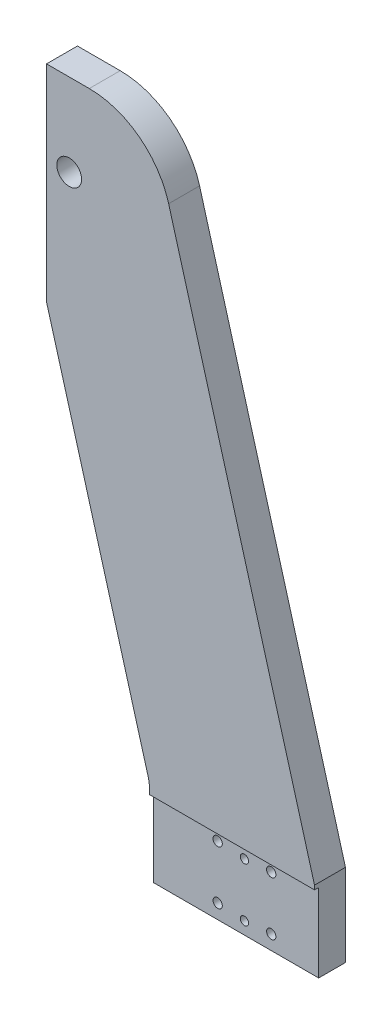
ISO-10303-21;
HEADER;
FILE_DESCRIPTION(('STEP AP214'),'2;1');
FILE_NAME('part.step','',(''),(''),'','','');
FILE_SCHEMA(('AUTOMOTIVE_DESIGN { 1 0 10303 214 1 1 1 1 }'));
ENDSEC;
DATA;
#1=APPLICATION_CONTEXT('core data for automotive mechanical design processes');
#2=APPLICATION_PROTOCOL_DEFINITION('international standard','automotive_design',2000,#1);
#3=PRODUCT_CONTEXT('',#1,'mechanical');
#4=PRODUCT('Part','Part','',(#3));
#5=PRODUCT_RELATED_PRODUCT_CATEGORY('part','',(#4));
#6=PRODUCT_DEFINITION_FORMATION('','',#4);
#7=PRODUCT_DEFINITION_CONTEXT('part definition',#1,'design');
#8=PRODUCT_DEFINITION('design','',#6,#7);
#9=PRODUCT_DEFINITION_SHAPE('','',#8);
#10=(LENGTH_UNIT() NAMED_UNIT(*) SI_UNIT(.MILLI.,.METRE.));
#11=(NAMED_UNIT(*) PLANE_ANGLE_UNIT() SI_UNIT($,.RADIAN.));
#12=(NAMED_UNIT(*) SI_UNIT($,.STERADIAN.) SOLID_ANGLE_UNIT());
#13=UNCERTAINTY_MEASURE_WITH_UNIT(LENGTH_MEASURE(1.E-05),#10,'distance_accuracy_value','');
#14=(GEOMETRIC_REPRESENTATION_CONTEXT(3) GLOBAL_UNCERTAINTY_ASSIGNED_CONTEXT((#13)) GLOBAL_UNIT_ASSIGNED_CONTEXT((#10,
#11,#12)) REPRESENTATION_CONTEXT('',''));
#15=CARTESIAN_POINT('',(0.,0.,0.));
#16=DIRECTION('',(0.,0.,1.));
#17=DIRECTION('',(1.,0.,0.));
#18=AXIS2_PLACEMENT_3D('',#15,#16,#17);
#19=CARTESIAN_POINT('',(-29.268839302064,280.,15.));
#20=DIRECTION('',(0.,0.,-1.));
#21=DIRECTION('',(-1.,0.,0.));
#22=AXIS2_PLACEMENT_3D('',#19,#20,#21);
#23=CYLINDRICAL_SURFACE('',#22,40.);
#24=CARTESIAN_POINT('',(-29.268839302064,280.,0.));
#25=DIRECTION('',(0.,0.,1.));
#26=DIRECTION('',(1.,0.,0.));
#27=AXIS2_PLACEMENT_3D('',#24,#25,#26);
#28=CIRCLE('',#27,40.);
#29=CARTESIAN_POINT('',(9.22850948471156,290.86066924224,0.));
#30=VERTEX_POINT('',#29);
#31=CARTESIAN_POINT('',(-29.268839302064,320.,0.));
#32=VERTEX_POINT('',#31);
#33=EDGE_CURVE('E155',#30,#32,#28,.T.);
#34=ORIENTED_EDGE('',*,*,#33,.T.);
#35=DIRECTION('',(0.,0.,-1.));
#36=VECTOR('',#35,1.);
#37=CARTESIAN_POINT('',(-29.268839302064,320.,15.));
#38=LINE('',#37,#36);
#39=CARTESIAN_POINT('',(-29.268839302064,320.,15.));
#40=VERTEX_POINT('',#39);
#41=EDGE_CURVE('E11',#40,#32,#38,.T.);
#42=ORIENTED_EDGE('',*,*,#41,.F.);
#43=CARTESIAN_POINT('',(-29.268839302064,280.,15.));
#44=DIRECTION('',(0.,0.,1.));
#45=DIRECTION('',(1.,0.,0.));
#46=AXIS2_PLACEMENT_3D('',#43,#44,#45);
#47=CIRCLE('',#46,40.);
#48=CARTESIAN_POINT('',(9.22850948471156,290.86066924224,15.));
#49=VERTEX_POINT('',#48);
#50=EDGE_CURVE('E174',#49,#40,#47,.T.);
#51=ORIENTED_EDGE('',*,*,#50,.F.);
#52=DIRECTION('',(0.,0.,-1.));
#53=VECTOR('',#52,1.);
#54=CARTESIAN_POINT('',(9.22850948471156,290.86066924224,15.));
#55=LINE('',#54,#53);
#56=EDGE_CURVE('E154',#49,#30,#55,.T.);
#57=ORIENTED_EDGE('',*,*,#56,.T.);
#58=EDGE_LOOP('',(#34,#42,#51,#57));
#59=FACE_BOUND('',#58,.T.);
#60=ADVANCED_FACE('F37',(#59),#23,.T.);
#61=CARTESIAN_POINT('',(-50.,320.,15.));
#62=DIRECTION('',(0.,-1.,0.));
#63=DIRECTION('',(1.,0.,0.));
#64=AXIS2_PLACEMENT_3D('',#61,#62,#63);
#65=PLANE('',#64);
#66=DIRECTION('',(-1.,0.,0.));
#67=VECTOR('',#66,1.);
#68=CARTESIAN_POINT('',(-50.,320.,0.));
#69=LINE('',#68,#67);
#70=CARTESIAN_POINT('',(-50.,320.,0.));
#71=VERTEX_POINT('',#70);
#72=EDGE_CURVE('E158',#32,#71,#69,.T.);
#73=ORIENTED_EDGE('',*,*,#72,.T.);
#74=DIRECTION('',(0.,0.,-1.));
#75=VECTOR('',#74,1.);
#76=CARTESIAN_POINT('',(-50.,320.,15.));
#77=LINE('',#76,#75);
#78=CARTESIAN_POINT('',(-50.,320.,15.));
#79=VERTEX_POINT('',#78);
#80=EDGE_CURVE('E45',#79,#71,#77,.T.);
#81=ORIENTED_EDGE('',*,*,#80,.F.);
#82=DIRECTION('',(-1.,0.,0.));
#83=VECTOR('',#82,1.);
#84=CARTESIAN_POINT('',(-50.,320.,15.));
#85=LINE('',#84,#83);
#86=EDGE_CURVE('E106',#40,#79,#85,.T.);
#87=ORIENTED_EDGE('',*,*,#86,.F.);
#88=ORIENTED_EDGE('',*,*,#41,.T.);
#89=EDGE_LOOP('',(#73,#81,#87,#88));
#90=FACE_BOUND('',#89,.T.);
#91=ADVANCED_FACE('F387',(#90),#65,.F.);
#92=CARTESIAN_POINT('',(-50.,320.,15.));
#93=DIRECTION('',(1.,0.,0.));
#94=DIRECTION('',(0.,1.,0.));
#95=AXIS2_PLACEMENT_3D('',#92,#93,#94);
#96=PLANE('',#95);
#97=CARTESIAN_POINT('',(-50.,312.,6.));
#98=DIRECTION('',(-1.,0.,0.));
#99=DIRECTION('',(0.,0.,1.));
#100=AXIS2_PLACEMENT_3D('',#97,#98,#99);
#101=CIRCLE('',#100,1.64999999999998);
#102=CARTESIAN_POINT('',(-50.,312.,7.64999999999999));
#103=VERTEX_POINT('',#102);
#104=EDGE_CURVE('E190',#103,#103,#101,.T.);
#105=ORIENTED_EDGE('',*,*,#104,.F.);
#106=EDGE_LOOP('',(#105));
#107=FACE_BOUND('',#106,.T.);
#108=CARTESIAN_POINT('',(-50.,248.,6.));
#109=DIRECTION('',(-1.,0.,0.));
#110=DIRECTION('',(0.,0.,1.));
#111=AXIS2_PLACEMENT_3D('',#108,#109,#110);
#112=CIRCLE('',#111,1.64999999999998);
#113=CARTESIAN_POINT('',(-50.,248.,7.64999999999999));
#114=VERTEX_POINT('',#113);
#115=EDGE_CURVE('E253',#114,#114,#112,.T.);
#116=ORIENTED_EDGE('',*,*,#115,.F.);
#117=EDGE_LOOP('',(#116));
#118=FACE_BOUND('',#117,.T.);
#119=CARTESIAN_POINT('',(-50.,291.,6.));
#120=DIRECTION('',(-1.,0.,0.));
#121=DIRECTION('',(0.,0.,1.));
#122=AXIS2_PLACEMENT_3D('',#119,#120,#121);
#123=CIRCLE('',#122,1.64999999999998);
#124=CARTESIAN_POINT('',(-50.,291.,7.64999999999999));
#125=VERTEX_POINT('',#124);
#126=EDGE_CURVE('E259',#125,#125,#123,.T.);
#127=ORIENTED_EDGE('',*,*,#126,.F.);
#128=EDGE_LOOP('',(#127));
#129=FACE_BOUND('',#128,.T.);
#130=CARTESIAN_POINT('',(-50.,269.,6.));
#131=DIRECTION('',(-1.,0.,0.));
#132=DIRECTION('',(0.,0.,1.));
#133=AXIS2_PLACEMENT_3D('',#130,#131,#132);
#134=CIRCLE('',#133,1.64999999999998);
#135=CARTESIAN_POINT('',(-50.,269.,7.64999999999999));
#136=VERTEX_POINT('',#135);
#137=EDGE_CURVE('E265',#136,#136,#134,.T.);
#138=ORIENTED_EDGE('',*,*,#137,.F.);
#139=EDGE_LOOP('',(#138));
#140=FACE_BOUND('',#139,.T.);
#141=CARTESIAN_POINT('',(-50.,304.,6.));
#142=DIRECTION('',(-1.,0.,0.));
#143=DIRECTION('',(0.,0.,1.));
#144=AXIS2_PLACEMENT_3D('',#141,#142,#143);
#145=CIRCLE('',#144,2.);
#146=CARTESIAN_POINT('',(-50.,304.,8.));
#147=VERTEX_POINT('',#146);
#148=EDGE_CURVE('E271',#147,#147,#145,.T.);
#149=ORIENTED_EDGE('',*,*,#148,.F.);
#150=EDGE_LOOP('',(#149));
#151=FACE_BOUND('',#150,.T.);
#152=CARTESIAN_POINT('',(-50.,256.,6.));
#153=DIRECTION('',(-1.,0.,0.));
#154=DIRECTION('',(0.,0.,1.));
#155=AXIS2_PLACEMENT_3D('',#152,#153,#154);
#156=CIRCLE('',#155,2.);
#157=CARTESIAN_POINT('',(-50.,256.,8.));
#158=VERTEX_POINT('',#157);
#159=EDGE_CURVE('E277',#158,#158,#156,.T.);
#160=ORIENTED_EDGE('',*,*,#159,.F.);
#161=EDGE_LOOP('',(#160));
#162=FACE_BOUND('',#161,.T.);
#163=DIRECTION('',(0.,-1.,0.));
#164=VECTOR('',#163,1.);
#165=CARTESIAN_POINT('',(-50.,320.,0.));
#166=LINE('',#165,#164);
#167=CARTESIAN_POINT('',(-50.,220.,0.));
#168=VERTEX_POINT('',#167);
#169=EDGE_CURVE('E161',#71,#168,#166,.T.);
#170=ORIENTED_EDGE('',*,*,#169,.T.);
#171=DIRECTION('',(0.,0.,-1.));
#172=VECTOR('',#171,1.);
#173=CARTESIAN_POINT('',(-50.,220.,15.));
#174=LINE('',#173,#172);
#175=CARTESIAN_POINT('',(-50.,220.,15.));
#176=VERTEX_POINT('',#175);
#177=EDGE_CURVE('E182',#176,#168,#174,.T.);
#178=ORIENTED_EDGE('',*,*,#177,.F.);
#179=DIRECTION('',(0.,-1.,0.));
#180=VECTOR('',#179,1.);
#181=CARTESIAN_POINT('',(-50.,320.,15.));
#182=LINE('',#181,#180);
#183=EDGE_CURVE('E318',#79,#176,#182,.T.);
#184=ORIENTED_EDGE('',*,*,#183,.F.);
#185=ORIENTED_EDGE('',*,*,#80,.T.);
#186=EDGE_LOOP('',(#170,#178,#184,#185));
#187=FACE_BOUND('',#186,.T.);
#188=ADVANCED_FACE('F322',(#107,#118,#129,#140,#151,#162,#187),#96,.F.);
#189=CARTESIAN_POINT('',(-50.,220.,15.));
#190=DIRECTION('',(0.96243371966939,0.27151673105601,0.));
#191=DIRECTION('',(-0.27151673105601,0.96243371966939,0.));
#192=AXIS2_PLACEMENT_3D('',#189,#190,#191);
#193=PLANE('',#192);
#194=DIRECTION('',(0.27151673105601,-0.96243371966939,0.));
#195=VECTOR('',#194,1.);
#196=CARTESIAN_POINT('',(-50.,220.,0.));
#197=LINE('',#196,#195);
#198=CARTESIAN_POINT('',(-0.751325606612161,45.4303346211202,0.));
#199=VERTEX_POINT('',#198);
#200=EDGE_CURVE('E163',#168,#199,#197,.T.);
#201=ORIENTED_EDGE('',*,*,#200,.T.);
#202=DIRECTION('',(0.,0.,-1.));
#203=VECTOR('',#202,1.);
#204=CARTESIAN_POINT('',(-0.751325606612161,45.4303346211202,15.));
#205=LINE('',#204,#203);
#206=CARTESIAN_POINT('',(-0.751325606612161,45.4303346211202,15.));
#207=VERTEX_POINT('',#206);
#208=EDGE_CURVE('E140',#207,#199,#205,.T.);
#209=ORIENTED_EDGE('',*,*,#208,.F.);
#210=DIRECTION('',(0.27151673105601,-0.96243371966939,0.));
#211=VECTOR('',#210,1.);
#212=CARTESIAN_POINT('',(-50.,220.,15.));
#213=LINE('',#212,#211);
#214=EDGE_CURVE('E127',#176,#207,#213,.T.);
#215=ORIENTED_EDGE('',*,*,#214,.F.);
#216=ORIENTED_EDGE('',*,*,#177,.T.);
#217=EDGE_LOOP('',(#201,#209,#215,#216));
#218=FACE_BOUND('',#217,.T.);
#219=ADVANCED_FACE('F326',(#218),#193,.F.);
#220=CARTESIAN_POINT('',(-20.,40.,15.));
#221=DIRECTION('',(0.,0.,-1.));
#222=DIRECTION('',(-1.,0.,0.));
#223=AXIS2_PLACEMENT_3D('',#220,#221,#222);
#224=CYLINDRICAL_SURFACE('',#223,20.);
#225=CARTESIAN_POINT('',(-20.,40.,0.));
#226=DIRECTION('',(0.,0.,-1.));
#227=DIRECTION('',(-1.,0.,0.));
#228=AXIS2_PLACEMENT_3D('',#225,#226,#227);
#229=CIRCLE('',#228,20.);
#230=CARTESIAN_POINT('',(0.,40.,0.));
#231=VERTEX_POINT('',#230);
#232=EDGE_CURVE('E136',#199,#231,#229,.T.);
#233=ORIENTED_EDGE('',*,*,#232,.T.);
#234=DIRECTION('',(0.,0.,-1.));
#235=VECTOR('',#234,1.);
#236=CARTESIAN_POINT('',(0.,40.,15.));
#237=LINE('',#236,#235);
#238=CARTESIAN_POINT('',(0.,40.,15.));
#239=VERTEX_POINT('',#238);
#240=EDGE_CURVE('E133',#239,#231,#237,.T.);
#241=ORIENTED_EDGE('',*,*,#240,.F.);
#242=CARTESIAN_POINT('',(-20.,40.,15.));
#243=DIRECTION('',(0.,0.,-1.));
#244=DIRECTION('',(-1.,0.,0.));
#245=AXIS2_PLACEMENT_3D('',#242,#243,#244);
#246=CIRCLE('',#245,20.);
#247=EDGE_CURVE('E119',#207,#239,#246,.T.);
#248=ORIENTED_EDGE('',*,*,#247,.F.);
#249=ORIENTED_EDGE('',*,*,#208,.T.);
#250=EDGE_LOOP('',(#233,#241,#248,#249));
#251=FACE_BOUND('',#250,.T.);
#252=ADVANCED_FACE('F134',(#251),#224,.F.);
#253=CARTESIAN_POINT('',(0.,40.,15.));
#254=DIRECTION('',(1.,0.,0.));
#255=DIRECTION('',(0.,1.,0.));
#256=AXIS2_PLACEMENT_3D('',#253,#254,#255);
#257=PLANE('',#256);
#258=DIRECTION('',(0.,-1.,0.));
#259=VECTOR('',#258,1.);
#260=CARTESIAN_POINT('',(0.,0.,13.));
#261=LINE('',#260,#259);
#262=CARTESIAN_POINT('',(0.,38.,13.));
#263=VERTEX_POINT('',#262);
#264=CARTESIAN_POINT('',(0.,0.,13.));
#265=VERTEX_POINT('',#264);
#266=EDGE_CURVE('E284',#263,#265,#261,.T.);
#267=ORIENTED_EDGE('',*,*,#266,.F.);
#268=DIRECTION('',(0.,0.,1.));
#269=VECTOR('',#268,1.);
#270=CARTESIAN_POINT('',(0.,38.,13.));
#271=LINE('',#270,#269);
#272=CARTESIAN_POINT('',(0.,38.,15.));
#273=VERTEX_POINT('',#272);
#274=EDGE_CURVE('E147',#263,#273,#271,.T.);
#275=ORIENTED_EDGE('',*,*,#274,.T.);
#276=DIRECTION('',(0.,-1.,0.));
#277=VECTOR('',#276,1.);
#278=CARTESIAN_POINT('',(0.,40.,15.));
#279=LINE('',#278,#277);
#280=EDGE_CURVE('E125',#239,#273,#279,.T.);
#281=ORIENTED_EDGE('',*,*,#280,.F.);
#282=ORIENTED_EDGE('',*,*,#240,.T.);
#283=DIRECTION('',(0.,-1.,0.));
#284=VECTOR('',#283,1.);
#285=CARTESIAN_POINT('',(0.,40.,0.));
#286=LINE('',#285,#284);
#287=CARTESIAN_POINT('',(0.,0.,0.));
#288=VERTEX_POINT('',#287);
#289=EDGE_CURVE('E166',#231,#288,#286,.T.);
#290=ORIENTED_EDGE('',*,*,#289,.T.);
#291=DIRECTION('',(0.,0.,-1.));
#292=VECTOR('',#291,1.);
#293=CARTESIAN_POINT('',(0.,0.,15.));
#294=LINE('',#293,#292);
#295=EDGE_CURVE('E141',#265,#288,#294,.T.);
#296=ORIENTED_EDGE('',*,*,#295,.F.);
#297=EDGE_LOOP('',(#267,#275,#281,#282,#290,#296));
#298=FACE_BOUND('',#297,.T.);
#299=ADVANCED_FACE('F145',(#298),#257,.F.);
#300=CARTESIAN_POINT('',(0.,0.,15.));
#301=DIRECTION('',(0.,1.,0.));
#302=DIRECTION('',(0.,0.,1.));
#303=AXIS2_PLACEMENT_3D('',#300,#301,#302);
#304=PLANE('',#303);
#305=DIRECTION('',(0.,0.,-1.));
#306=VECTOR('',#305,1.);
#307=CARTESIAN_POINT('',(80.,0.,15.));
#308=LINE('',#307,#306);
#309=CARTESIAN_POINT('',(80.,0.,13.));
#310=VERTEX_POINT('',#309);
#311=CARTESIAN_POINT('',(80.,0.,0.));
#312=VERTEX_POINT('',#311);
#313=EDGE_CURVE('E178',#310,#312,#308,.T.);
#314=ORIENTED_EDGE('',*,*,#313,.F.);
#315=DIRECTION('',(1.,0.,0.));
#316=VECTOR('',#315,1.);
#317=CARTESIAN_POINT('',(0.,0.,13.));
#318=LINE('',#317,#316);
#319=EDGE_CURVE('E287',#265,#310,#318,.T.);
#320=ORIENTED_EDGE('',*,*,#319,.F.);
#321=ORIENTED_EDGE('',*,*,#295,.T.);
#322=DIRECTION('',(1.,0.,0.));
#323=VECTOR('',#322,1.);
#324=CARTESIAN_POINT('',(0.,0.,0.));
#325=LINE('',#324,#323);
#326=EDGE_CURVE('E168',#288,#312,#325,.T.);
#327=ORIENTED_EDGE('',*,*,#326,.T.);
#328=EDGE_LOOP('',(#314,#320,#321,#327));
#329=FACE_BOUND('',#328,.T.);
#330=ADVANCED_FACE('F340',(#329),#304,.F.);
#331=CARTESIAN_POINT('',(80.,0.,15.));
#332=DIRECTION('',(-1.,0.,0.));
#333=DIRECTION('',(0.,-1.,0.));
#334=AXIS2_PLACEMENT_3D('',#331,#332,#333);
#335=PLANE('',#334);
#336=DIRECTION('',(0.,1.,0.));
#337=VECTOR('',#336,1.);
#338=CARTESIAN_POINT('',(80.,0.,15.));
#339=LINE('',#338,#337);
#340=CARTESIAN_POINT('',(80.,38.,15.));
#341=VERTEX_POINT('',#340);
#342=CARTESIAN_POINT('',(80.,40.,15.));
#343=VERTEX_POINT('',#342);
#344=EDGE_CURVE('E148',#341,#343,#339,.T.);
#345=ORIENTED_EDGE('',*,*,#344,.F.);
#346=DIRECTION('',(0.,0.,1.));
#347=VECTOR('',#346,1.);
#348=CARTESIAN_POINT('',(80.,38.,13.));
#349=LINE('',#348,#347);
#350=CARTESIAN_POINT('',(80.,38.,13.));
#351=VERTEX_POINT('',#350);
#352=EDGE_CURVE('E53',#351,#341,#349,.T.);
#353=ORIENTED_EDGE('',*,*,#352,.F.);
#354=DIRECTION('',(0.,1.,0.));
#355=VECTOR('',#354,1.);
#356=CARTESIAN_POINT('',(80.,0.,13.));
#357=LINE('',#356,#355);
#358=EDGE_CURVE('E290',#310,#351,#357,.T.);
#359=ORIENTED_EDGE('',*,*,#358,.F.);
#360=ORIENTED_EDGE('',*,*,#313,.T.);
#361=DIRECTION('',(0.,1.,0.));
#362=VECTOR('',#361,1.);
#363=CARTESIAN_POINT('',(80.,0.,0.));
#364=LINE('',#363,#362);
#365=CARTESIAN_POINT('',(80.,40.,0.));
#366=VERTEX_POINT('',#365);
#367=EDGE_CURVE('E171',#312,#366,#364,.T.);
#368=ORIENTED_EDGE('',*,*,#367,.T.);
#369=DIRECTION('',(0.,0.,-1.));
#370=VECTOR('',#369,1.);
#371=CARTESIAN_POINT('',(80.,40.,15.));
#372=LINE('',#371,#370);
#373=EDGE_CURVE('E176',#343,#366,#372,.T.);
#374=ORIENTED_EDGE('',*,*,#373,.F.);
#375=EDGE_LOOP('',(#345,#353,#359,#360,#368,#374));
#376=FACE_BOUND('',#375,.T.);
#377=ADVANCED_FACE('F348',(#376),#335,.F.);
#378=CARTESIAN_POINT('',(9.22850948471156,290.86066924224,15.));
#379=DIRECTION('',(-0.96243371966939,-0.27151673105601,0.));
#380=DIRECTION('',(0.27151673105601,-0.96243371966939,0.));
#381=AXIS2_PLACEMENT_3D('',#378,#379,#380);
#382=PLANE('',#381);
#383=DIRECTION('',(-0.27151673105601,0.96243371966939,0.));
#384=VECTOR('',#383,1.);
#385=CARTESIAN_POINT('',(9.22850948471156,290.86066924224,0.));
#386=LINE('',#385,#384);
#387=EDGE_CURVE('E98',#366,#30,#386,.T.);
#388=ORIENTED_EDGE('',*,*,#387,.T.);
#389=ORIENTED_EDGE('',*,*,#56,.F.);
#390=DIRECTION('',(-0.27151673105601,0.96243371966939,0.));
#391=VECTOR('',#390,1.);
#392=CARTESIAN_POINT('',(9.22850948471156,290.86066924224,15.));
#393=LINE('',#392,#391);
#394=EDGE_CURVE('E62',#343,#49,#393,.T.);
#395=ORIENTED_EDGE('',*,*,#394,.F.);
#396=ORIENTED_EDGE('',*,*,#373,.T.);
#397=EDGE_LOOP('',(#388,#389,#395,#396));
#398=FACE_BOUND('',#397,.T.);
#399=ADVANCED_FACE('F394',(#398),#382,.F.);
#400=CARTESIAN_POINT('',(-29.268839302064,280.,15.));
#401=DIRECTION('',(0.,0.,1.));
#402=DIRECTION('',(1.,0.,0.));
#403=AXIS2_PLACEMENT_3D('',#400,#401,#402);
#404=PLANE('',#403);
#405=DIRECTION('',(-1.,0.,0.));
#406=VECTOR('',#405,1.);
#407=CARTESIAN_POINT('',(0.,38.,15.));
#408=LINE('',#407,#406);
#409=EDGE_CURVE('E283',#341,#273,#408,.T.);
#410=ORIENTED_EDGE('',*,*,#409,.F.);
#411=ORIENTED_EDGE('',*,*,#344,.T.);
#412=ORIENTED_EDGE('',*,*,#394,.T.);
#413=ORIENTED_EDGE('',*,*,#50,.T.);
#414=ORIENTED_EDGE('',*,*,#86,.T.);
#415=ORIENTED_EDGE('',*,*,#183,.T.);
#416=ORIENTED_EDGE('',*,*,#214,.T.);
#417=ORIENTED_EDGE('',*,*,#247,.T.);
#418=ORIENTED_EDGE('',*,*,#280,.T.);
#419=EDGE_LOOP('',(#410,#411,#412,#413,#414,#415,#416,#417,#418));
#420=FACE_BOUND('',#419,.T.);
#421=CARTESIAN_POINT('',(-39.,280.,15.));
#422=DIRECTION('',(0.,0.,-1.));
#423=DIRECTION('',(-1.,0.,0.));
#424=AXIS2_PLACEMENT_3D('',#421,#422,#423);
#425=CIRCLE('',#424,6.);
#426=CARTESIAN_POINT('',(-45.,280.,15.));
#427=VERTEX_POINT('',#426);
#428=EDGE_CURVE('E159',#427,#427,#425,.T.);
#429=ORIENTED_EDGE('',*,*,#428,.T.);
#430=EDGE_LOOP('',(#429));
#431=FACE_BOUND('',#430,.T.);
#432=ADVANCED_FACE('F121',(#420,#431),#404,.T.);
#433=CARTESIAN_POINT('',(-29.268839302064,280.,0.));
#434=DIRECTION('',(0.,0.,1.));
#435=DIRECTION('',(1.,0.,0.));
#436=AXIS2_PLACEMENT_3D('',#433,#434,#435);
#437=PLANE('',#436);
#438=CARTESIAN_POINT('',(44.,32.,0.));
#439=DIRECTION('',(0.,0.,-1.));
#440=DIRECTION('',(-1.,0.,0.));
#441=AXIS2_PLACEMENT_3D('',#438,#439,#440);
#442=CIRCLE('',#441,1.99999999999999);
#443=CARTESIAN_POINT('',(42.,32.,0.));
#444=VERTEX_POINT('',#443);
#445=EDGE_CURVE('E220',#444,#444,#442,.T.);
#446=ORIENTED_EDGE('',*,*,#445,.F.);
#447=EDGE_LOOP('',(#446));
#448=FACE_BOUND('',#447,.T.);
#449=CARTESIAN_POINT('',(44.,6.,0.));
#450=DIRECTION('',(0.,0.,-1.));
#451=DIRECTION('',(-1.,0.,0.));
#452=AXIS2_PLACEMENT_3D('',#449,#450,#451);
#453=CIRCLE('',#452,1.99999999999999);
#454=CARTESIAN_POINT('',(42.,6.,0.));
#455=VERTEX_POINT('',#454);
#456=EDGE_CURVE('E209',#455,#455,#453,.T.);
#457=ORIENTED_EDGE('',*,*,#456,.F.);
#458=EDGE_LOOP('',(#457));
#459=FACE_BOUND('',#458,.T.);
#460=CARTESIAN_POINT('',(57.,33.,0.));
#461=DIRECTION('',(0.,0.,-1.));
#462=DIRECTION('',(-1.,0.,0.));
#463=AXIS2_PLACEMENT_3D('',#460,#461,#462);
#464=CIRCLE('',#463,3.99999999999999);
#465=CARTESIAN_POINT('',(53.,33.,0.));
#466=VERTEX_POINT('',#465);
#467=EDGE_CURVE('E208',#466,#466,#464,.T.);
#468=ORIENTED_EDGE('',*,*,#467,.F.);
#469=EDGE_LOOP('',(#468));
#470=FACE_BOUND('',#469,.T.);
#471=CARTESIAN_POINT('',(31.,33.,0.));
#472=DIRECTION('',(0.,0.,-1.));
#473=DIRECTION('',(-1.,0.,0.));
#474=AXIS2_PLACEMENT_3D('',#471,#472,#473);
#475=CIRCLE('',#474,4.);
#476=CARTESIAN_POINT('',(27.,33.,0.));
#477=VERTEX_POINT('',#476);
#478=EDGE_CURVE('E204',#477,#477,#475,.T.);
#479=ORIENTED_EDGE('',*,*,#478,.F.);
#480=EDGE_LOOP('',(#479));
#481=FACE_BOUND('',#480,.T.);
#482=CARTESIAN_POINT('',(31.,7.,0.));
#483=DIRECTION('',(0.,0.,-1.));
#484=DIRECTION('',(-1.,0.,0.));
#485=AXIS2_PLACEMENT_3D('',#482,#483,#484);
#486=CIRCLE('',#485,4.);
#487=CARTESIAN_POINT('',(27.,7.,0.));
#488=VERTEX_POINT('',#487);
#489=EDGE_CURVE('E200',#488,#488,#486,.T.);
#490=ORIENTED_EDGE('',*,*,#489,.F.);
#491=EDGE_LOOP('',(#490));
#492=FACE_BOUND('',#491,.T.);
#493=CARTESIAN_POINT('',(57.,7.,0.));
#494=DIRECTION('',(0.,0.,-1.));
#495=DIRECTION('',(-1.,0.,0.));
#496=AXIS2_PLACEMENT_3D('',#493,#494,#495);
#497=CIRCLE('',#496,3.99999999999999);
#498=CARTESIAN_POINT('',(53.,7.,0.));
#499=VERTEX_POINT('',#498);
#500=EDGE_CURVE('E195',#499,#499,#497,.T.);
#501=ORIENTED_EDGE('',*,*,#500,.F.);
#502=EDGE_LOOP('',(#501));
#503=FACE_BOUND('',#502,.T.);
#504=CARTESIAN_POINT('',(-39.,298.25,0.));
#505=DIRECTION('',(0.,0.,-1.));
#506=DIRECTION('',(-1.,0.,0.));
#507=AXIS2_PLACEMENT_3D('',#504,#505,#506);
#508=CIRCLE('',#507,1.65);
#509=CARTESIAN_POINT('',(-40.65,298.25,0.));
#510=VERTEX_POINT('',#509);
#511=EDGE_CURVE('E298',#510,#510,#508,.T.);
#512=ORIENTED_EDGE('',*,*,#511,.F.);
#513=EDGE_LOOP('',(#512));
#514=FACE_BOUND('',#513,.T.);
#515=CARTESIAN_POINT('',(-39.,261.75,0.));
#516=DIRECTION('',(0.,0.,-1.));
#517=DIRECTION('',(-1.,0.,0.));
#518=AXIS2_PLACEMENT_3D('',#515,#516,#517);
#519=CIRCLE('',#518,1.65);
#520=CARTESIAN_POINT('',(-40.65,261.75,0.));
#521=VERTEX_POINT('',#520);
#522=EDGE_CURVE('E305',#521,#521,#519,.T.);
#523=ORIENTED_EDGE('',*,*,#522,.F.);
#524=EDGE_LOOP('',(#523));
#525=FACE_BOUND('',#524,.T.);
#526=CARTESIAN_POINT('',(-39.,280.,0.));
#527=DIRECTION('',(0.,0.,-1.));
#528=DIRECTION('',(-1.,0.,0.));
#529=AXIS2_PLACEMENT_3D('',#526,#527,#528);
#530=CIRCLE('',#529,6.);
#531=CARTESIAN_POINT('',(-45.,280.,0.));
#532=VERTEX_POINT('',#531);
#533=EDGE_CURVE('E311',#532,#532,#530,.T.);
#534=ORIENTED_EDGE('',*,*,#533,.F.);
#535=EDGE_LOOP('',(#534));
#536=FACE_BOUND('',#535,.T.);
#537=ORIENTED_EDGE('',*,*,#33,.F.);
#538=ORIENTED_EDGE('',*,*,#387,.F.);
#539=ORIENTED_EDGE('',*,*,#367,.F.);
#540=ORIENTED_EDGE('',*,*,#326,.F.);
#541=ORIENTED_EDGE('',*,*,#289,.F.);
#542=ORIENTED_EDGE('',*,*,#232,.F.);
#543=ORIENTED_EDGE('',*,*,#200,.F.);
#544=ORIENTED_EDGE('',*,*,#169,.F.);
#545=ORIENTED_EDGE('',*,*,#72,.F.);
#546=EDGE_LOOP('',(#537,#538,#539,#540,#541,#542,#543,#544,#545));
#547=FACE_BOUND('',#546,.T.);
#548=ADVANCED_FACE('F329',(#448,#459,#470,#481,#492,#503,#514,#525,#536,#547),#437,.F.);
#549=CARTESIAN_POINT('',(-39.,280.,15.));
#550=DIRECTION('',(0.,0.,-1.));
#551=DIRECTION('',(-1.,0.,0.));
#552=AXIS2_PLACEMENT_3D('',#549,#550,#551);
#553=CYLINDRICAL_SURFACE('',#552,6.);
#554=ORIENTED_EDGE('',*,*,#428,.F.);
#555=EDGE_LOOP('',(#554));
#556=FACE_BOUND('',#555,.T.);
#557=ORIENTED_EDGE('',*,*,#533,.T.);
#558=EDGE_LOOP('',(#557));
#559=FACE_BOUND('',#558,.T.);
#560=ADVANCED_FACE('F363',(#556,#559),#553,.F.);
#561=CARTESIAN_POINT('',(-39.,261.75,7.));
#562=DIRECTION('',(0.,0.,-1.));
#563=DIRECTION('',(-1.,0.,0.));
#564=AXIS2_PLACEMENT_3D('',#561,#562,#563);
#565=CONICAL_SURFACE('',#564,1.65,1.02974425867665);
#566=CARTESIAN_POINT('',(-39.,261.75,7.99142002139547));
#567=VERTEX_POINT('',#566);
#568=VERTEX_LOOP('',#567);
#569=FACE_BOUND('',#568,.T.);
#570=CARTESIAN_POINT('',(-39.,261.75,7.));
#571=DIRECTION('',(0.,0.,-1.));
#572=DIRECTION('',(-1.,0.,0.));
#573=AXIS2_PLACEMENT_3D('',#570,#571,#572);
#574=CIRCLE('',#573,1.65);
#575=CARTESIAN_POINT('',(-40.65,261.75,7.));
#576=VERTEX_POINT('',#575);
#577=EDGE_CURVE('E308',#576,#576,#574,.T.);
#578=ORIENTED_EDGE('',*,*,#577,.T.);
#579=EDGE_LOOP('',(#578));
#580=FACE_BOUND('',#579,.T.);
#581=ADVANCED_FACE('F359',(#569,#580),#565,.F.);
#582=CARTESIAN_POINT('',(-39.,261.75,0.));
#583=DIRECTION('',(0.,0.,-1.));
#584=DIRECTION('',(-1.,0.,0.));
#585=AXIS2_PLACEMENT_3D('',#582,#583,#584);
#586=CYLINDRICAL_SURFACE('',#585,1.65);
#587=ORIENTED_EDGE('',*,*,#577,.F.);
#588=EDGE_LOOP('',(#587));
#589=FACE_BOUND('',#588,.T.);
#590=ORIENTED_EDGE('',*,*,#522,.T.);
#591=EDGE_LOOP('',(#590));
#592=FACE_BOUND('',#591,.T.);
#593=ADVANCED_FACE('F362',(#589,#592),#586,.F.);
#594=CARTESIAN_POINT('',(-39.,298.25,7.));
#595=DIRECTION('',(0.,0.,-1.));
#596=DIRECTION('',(-1.,0.,0.));
#597=AXIS2_PLACEMENT_3D('',#594,#595,#596);
#598=CONICAL_SURFACE('',#597,1.65,1.02974425867665);
#599=CARTESIAN_POINT('',(-39.,298.25,7.99142002139547));
#600=VERTEX_POINT('',#599);
#601=VERTEX_LOOP('',#600);
#602=FACE_BOUND('',#601,.T.);
#603=CARTESIAN_POINT('',(-39.,298.25,7.));
#604=DIRECTION('',(0.,0.,-1.));
#605=DIRECTION('',(-1.,0.,0.));
#606=AXIS2_PLACEMENT_3D('',#603,#604,#605);
#607=CIRCLE('',#606,1.65);
#608=CARTESIAN_POINT('',(-40.65,298.25,7.));
#609=VERTEX_POINT('',#608);
#610=EDGE_CURVE('E302',#609,#609,#607,.T.);
#611=ORIENTED_EDGE('',*,*,#610,.T.);
#612=EDGE_LOOP('',(#611));
#613=FACE_BOUND('',#612,.T.);
#614=ADVANCED_FACE('F369',(#602,#613),#598,.F.);
#615=CARTESIAN_POINT('',(-39.,298.25,0.));
#616=DIRECTION('',(0.,0.,-1.));
#617=DIRECTION('',(-1.,0.,0.));
#618=AXIS2_PLACEMENT_3D('',#615,#616,#617);
#619=CYLINDRICAL_SURFACE('',#618,1.65);
#620=ORIENTED_EDGE('',*,*,#610,.F.);
#621=EDGE_LOOP('',(#620));
#622=FACE_BOUND('',#621,.T.);
#623=ORIENTED_EDGE('',*,*,#511,.T.);
#624=EDGE_LOOP('',(#623));
#625=FACE_BOUND('',#624,.T.);
#626=ADVANCED_FACE('F451',(#622,#625),#619,.F.);
#627=CARTESIAN_POINT('',(0.,38.,13.));
#628=DIRECTION('',(0.,1.,0.));
#629=DIRECTION('',(0.,0.,1.));
#630=AXIS2_PLACEMENT_3D('',#627,#628,#629);
#631=PLANE('',#630);
#632=ORIENTED_EDGE('',*,*,#409,.T.);
#633=ORIENTED_EDGE('',*,*,#274,.F.);
#634=DIRECTION('',(-1.,0.,0.));
#635=VECTOR('',#634,1.);
#636=CARTESIAN_POINT('',(0.,38.,13.));
#637=LINE('',#636,#635);
#638=EDGE_CURVE('E293',#351,#263,#637,.T.);
#639=ORIENTED_EDGE('',*,*,#638,.F.);
#640=ORIENTED_EDGE('',*,*,#352,.T.);
#641=EDGE_LOOP('',(#632,#633,#639,#640));
#642=FACE_BOUND('',#641,.T.);
#643=ADVANCED_FACE('F447',(#642),#631,.F.);
#644=CARTESIAN_POINT('',(0.,0.,13.));
#645=DIRECTION('',(0.,0.,-1.));
#646=DIRECTION('',(-1.,0.,0.));
#647=AXIS2_PLACEMENT_3D('',#644,#645,#646);
#648=PLANE('',#647);
#649=CARTESIAN_POINT('',(44.,32.,13.));
#650=DIRECTION('',(0.,0.,-1.));
#651=DIRECTION('',(-1.,0.,0.));
#652=AXIS2_PLACEMENT_3D('',#649,#650,#651);
#653=CIRCLE('',#652,1.99999999999999);
#654=CARTESIAN_POINT('',(42.,32.,13.));
#655=VERTEX_POINT('',#654);
#656=EDGE_CURVE('E40',#655,#655,#653,.T.);
#657=ORIENTED_EDGE('',*,*,#656,.T.);
#658=EDGE_LOOP('',(#657));
#659=FACE_BOUND('',#658,.T.);
#660=CARTESIAN_POINT('',(44.,6.,13.));
#661=DIRECTION('',(0.,0.,-1.));
#662=DIRECTION('',(-1.,0.,0.));
#663=AXIS2_PLACEMENT_3D('',#660,#661,#662);
#664=CIRCLE('',#663,1.99999999999999);
#665=CARTESIAN_POINT('',(42.,6.,13.));
#666=VERTEX_POINT('',#665);
#667=EDGE_CURVE('E206',#666,#666,#664,.T.);
#668=ORIENTED_EDGE('',*,*,#667,.T.);
#669=EDGE_LOOP('',(#668));
#670=FACE_BOUND('',#669,.T.);
#671=CARTESIAN_POINT('',(57.,33.,13.));
#672=DIRECTION('',(0.,0.,-1.));
#673=DIRECTION('',(-1.,0.,0.));
#674=AXIS2_PLACEMENT_3D('',#671,#672,#673);
#675=CIRCLE('',#674,2.25);
#676=CARTESIAN_POINT('',(54.75,33.,13.));
#677=VERTEX_POINT('',#676);
#678=EDGE_CURVE('E202',#677,#677,#675,.T.);
#679=ORIENTED_EDGE('',*,*,#678,.T.);
#680=EDGE_LOOP('',(#679));
#681=FACE_BOUND('',#680,.T.);
#682=CARTESIAN_POINT('',(31.,33.,13.));
#683=DIRECTION('',(0.,0.,-1.));
#684=DIRECTION('',(-1.,0.,0.));
#685=AXIS2_PLACEMENT_3D('',#682,#683,#684);
#686=CIRCLE('',#685,2.25);
#687=CARTESIAN_POINT('',(28.75,33.,13.));
#688=VERTEX_POINT('',#687);
#689=EDGE_CURVE('E197',#688,#688,#686,.T.);
#690=ORIENTED_EDGE('',*,*,#689,.T.);
#691=EDGE_LOOP('',(#690));
#692=FACE_BOUND('',#691,.T.);
#693=CARTESIAN_POINT('',(31.,7.,13.));
#694=DIRECTION('',(0.,0.,-1.));
#695=DIRECTION('',(-1.,0.,0.));
#696=AXIS2_PLACEMENT_3D('',#693,#694,#695);
#697=CIRCLE('',#696,2.25);
#698=CARTESIAN_POINT('',(28.75,7.,13.));
#699=VERTEX_POINT('',#698);
#700=EDGE_CURVE('E192',#699,#699,#697,.T.);
#701=ORIENTED_EDGE('',*,*,#700,.T.);
#702=EDGE_LOOP('',(#701));
#703=FACE_BOUND('',#702,.T.);
#704=CARTESIAN_POINT('',(57.,7.,13.));
#705=DIRECTION('',(0.,0.,-1.));
#706=DIRECTION('',(-1.,0.,0.));
#707=AXIS2_PLACEMENT_3D('',#704,#705,#706);
#708=CIRCLE('',#707,2.25);
#709=CARTESIAN_POINT('',(54.75,7.,13.));
#710=VERTEX_POINT('',#709);
#711=EDGE_CURVE('E187',#710,#710,#708,.T.);
#712=ORIENTED_EDGE('',*,*,#711,.T.);
#713=EDGE_LOOP('',(#712));
#714=FACE_BOUND('',#713,.T.);
#715=ORIENTED_EDGE('',*,*,#266,.T.);
#716=ORIENTED_EDGE('',*,*,#319,.T.);
#717=ORIENTED_EDGE('',*,*,#358,.T.);
#718=ORIENTED_EDGE('',*,*,#638,.T.);
#719=EDGE_LOOP('',(#715,#716,#717,#718));
#720=FACE_BOUND('',#719,.T.);
#721=ADVANCED_FACE('F343',(#659,#670,#681,#692,#703,#714,#720),#648,.F.);
#722=CARTESIAN_POINT('',(-33.,256.,6.));
#723=DIRECTION('',(-1.,0.,0.));
#724=DIRECTION('',(0.,0.,1.));
#725=AXIS2_PLACEMENT_3D('',#722,#723,#724);
#726=CONICAL_SURFACE('',#725,2.,1.02974425867666);
#727=CARTESIAN_POINT('',(-31.7982787619449,256.,6.));
#728=VERTEX_POINT('',#727);
#729=VERTEX_LOOP('',#728);
#730=FACE_BOUND('',#729,.T.);
#731=CARTESIAN_POINT('',(-33.,256.,6.));
#732=DIRECTION('',(-1.,0.,0.));
#733=DIRECTION('',(0.,0.,1.));
#734=AXIS2_PLACEMENT_3D('',#731,#732,#733);
#735=CIRCLE('',#734,2.);
#736=CARTESIAN_POINT('',(-33.,256.,8.));
#737=VERTEX_POINT('',#736);
#738=EDGE_CURVE('E280',#737,#737,#735,.T.);
#739=ORIENTED_EDGE('',*,*,#738,.T.);
#740=EDGE_LOOP('',(#739));
#741=FACE_BOUND('',#740,.T.);
#742=ADVANCED_FACE('F430',(#730,#741),#726,.F.);
#743=CARTESIAN_POINT('',(-50.,256.,6.));
#744=DIRECTION('',(-1.,0.,0.));
#745=DIRECTION('',(0.,0.,1.));
#746=AXIS2_PLACEMENT_3D('',#743,#744,#745);
#747=CYLINDRICAL_SURFACE('',#746,2.);
#748=ORIENTED_EDGE('',*,*,#738,.F.);
#749=EDGE_LOOP('',(#748));
#750=FACE_BOUND('',#749,.T.);
#751=ORIENTED_EDGE('',*,*,#159,.T.);
#752=EDGE_LOOP('',(#751));
#753=FACE_BOUND('',#752,.T.);
#754=ADVANCED_FACE('F427',(#750,#753),#747,.F.);
#755=CARTESIAN_POINT('',(-33.,304.,6.));
#756=DIRECTION('',(-1.,0.,0.));
#757=DIRECTION('',(0.,0.,1.));
#758=AXIS2_PLACEMENT_3D('',#755,#756,#757);
#759=CONICAL_SURFACE('',#758,2.,1.02974425867666);
#760=CARTESIAN_POINT('',(-31.7982787619449,304.,6.));
#761=VERTEX_POINT('',#760);
#762=VERTEX_LOOP('',#761);
#763=FACE_BOUND('',#762,.T.);
#764=CARTESIAN_POINT('',(-33.,304.,6.));
#765=DIRECTION('',(-1.,0.,0.));
#766=DIRECTION('',(0.,0.,1.));
#767=AXIS2_PLACEMENT_3D('',#764,#765,#766);
#768=CIRCLE('',#767,2.);
#769=CARTESIAN_POINT('',(-33.,304.,8.));
#770=VERTEX_POINT('',#769);
#771=EDGE_CURVE('E274',#770,#770,#768,.T.);
#772=ORIENTED_EDGE('',*,*,#771,.T.);
#773=EDGE_LOOP('',(#772));
#774=FACE_BOUND('',#773,.T.);
#775=ADVANCED_FACE('F429',(#763,#774),#759,.F.);
#776=CARTESIAN_POINT('',(-50.,304.,6.));
#777=DIRECTION('',(-1.,0.,0.));
#778=DIRECTION('',(0.,0.,1.));
#779=AXIS2_PLACEMENT_3D('',#776,#777,#778);
#780=CYLINDRICAL_SURFACE('',#779,2.);
#781=ORIENTED_EDGE('',*,*,#771,.F.);
#782=EDGE_LOOP('',(#781));
#783=FACE_BOUND('',#782,.T.);
#784=ORIENTED_EDGE('',*,*,#148,.T.);
#785=EDGE_LOOP('',(#784));
#786=FACE_BOUND('',#785,.T.);
#787=ADVANCED_FACE('F437',(#783,#786),#780,.F.);
#788=CARTESIAN_POINT('',(-38.5,269.,6.));
#789=DIRECTION('',(-1.,0.,0.));
#790=DIRECTION('',(0.,0.,1.));
#791=AXIS2_PLACEMENT_3D('',#788,#789,#790);
#792=CONICAL_SURFACE('',#791,1.64999999999998,1.02974425867665);
#793=CARTESIAN_POINT('',(-37.5085799786045,269.,6.));
#794=VERTEX_POINT('',#793);
#795=VERTEX_LOOP('',#794);
#796=FACE_BOUND('',#795,.T.);
#797=CARTESIAN_POINT('',(-38.5,269.,6.));
#798=DIRECTION('',(-1.,0.,0.));
#799=DIRECTION('',(0.,0.,1.));
#800=AXIS2_PLACEMENT_3D('',#797,#798,#799);
#801=CIRCLE('',#800,1.64999999999998);
#802=CARTESIAN_POINT('',(-38.5,269.,7.64999999999999));
#803=VERTEX_POINT('',#802);
#804=EDGE_CURVE('E268',#803,#803,#801,.T.);
#805=ORIENTED_EDGE('',*,*,#804,.T.);
#806=EDGE_LOOP('',(#805));
#807=FACE_BOUND('',#806,.T.);
#808=ADVANCED_FACE('F503',(#796,#807),#792,.F.);
#809=CARTESIAN_POINT('',(-50.,269.,6.));
#810=DIRECTION('',(-1.,0.,0.));
#811=DIRECTION('',(0.,0.,1.));
#812=AXIS2_PLACEMENT_3D('',#809,#810,#811);
#813=CYLINDRICAL_SURFACE('',#812,1.64999999999998);
#814=ORIENTED_EDGE('',*,*,#804,.F.);
#815=EDGE_LOOP('',(#814));
#816=FACE_BOUND('',#815,.T.);
#817=ORIENTED_EDGE('',*,*,#137,.T.);
#818=EDGE_LOOP('',(#817));
#819=FACE_BOUND('',#818,.T.);
#820=ADVANCED_FACE('F519',(#816,#819),#813,.F.);
#821=CARTESIAN_POINT('',(-38.5,291.,6.));
#822=DIRECTION('',(-1.,0.,0.));
#823=DIRECTION('',(0.,0.,1.));
#824=AXIS2_PLACEMENT_3D('',#821,#822,#823);
#825=CONICAL_SURFACE('',#824,1.64999999999998,1.02974425867665);
#826=CARTESIAN_POINT('',(-37.5085799786046,291.,6.));
#827=VERTEX_POINT('',#826);
#828=VERTEX_LOOP('',#827);
#829=FACE_BOUND('',#828,.T.);
#830=CARTESIAN_POINT('',(-38.5,291.,6.));
#831=DIRECTION('',(-1.,0.,0.));
#832=DIRECTION('',(0.,0.,1.));
#833=AXIS2_PLACEMENT_3D('',#830,#831,#832);
#834=CIRCLE('',#833,1.64999999999998);
#835=CARTESIAN_POINT('',(-38.5,291.,7.64999999999999));
#836=VERTEX_POINT('',#835);
#837=EDGE_CURVE('E262',#836,#836,#834,.T.);
#838=ORIENTED_EDGE('',*,*,#837,.T.);
#839=EDGE_LOOP('',(#838));
#840=FACE_BOUND('',#839,.T.);
#841=ADVANCED_FACE('F530',(#829,#840),#825,.F.);
#842=CARTESIAN_POINT('',(-50.,291.,6.));
#843=DIRECTION('',(-1.,0.,0.));
#844=DIRECTION('',(0.,0.,1.));
#845=AXIS2_PLACEMENT_3D('',#842,#843,#844);
#846=CYLINDRICAL_SURFACE('',#845,1.64999999999998);
#847=ORIENTED_EDGE('',*,*,#837,.F.);
#848=EDGE_LOOP('',(#847));
#849=FACE_BOUND('',#848,.T.);
#850=ORIENTED_EDGE('',*,*,#126,.T.);
#851=EDGE_LOOP('',(#850));
#852=FACE_BOUND('',#851,.T.);
#853=ADVANCED_FACE('F543',(#849,#852),#846,.F.);
#854=CARTESIAN_POINT('',(-38.5,248.,6.));
#855=DIRECTION('',(-1.,0.,0.));
#856=DIRECTION('',(0.,0.,1.));
#857=AXIS2_PLACEMENT_3D('',#854,#855,#856);
#858=CONICAL_SURFACE('',#857,1.64999999999998,1.02974425867665);
#859=CARTESIAN_POINT('',(-37.5085799786045,248.,6.));
#860=VERTEX_POINT('',#859);
#861=VERTEX_LOOP('',#860);
#862=FACE_BOUND('',#861,.T.);
#863=CARTESIAN_POINT('',(-38.5,248.,6.));
#864=DIRECTION('',(-1.,0.,0.));
#865=DIRECTION('',(0.,0.,1.));
#866=AXIS2_PLACEMENT_3D('',#863,#864,#865);
#867=CIRCLE('',#866,1.64999999999998);
#868=CARTESIAN_POINT('',(-38.5,248.,7.64999999999999));
#869=VERTEX_POINT('',#868);
#870=EDGE_CURVE('E256',#869,#869,#867,.T.);
#871=ORIENTED_EDGE('',*,*,#870,.T.);
#872=EDGE_LOOP('',(#871));
#873=FACE_BOUND('',#872,.T.);
#874=ADVANCED_FACE('F553',(#862,#873),#858,.F.);
#875=CARTESIAN_POINT('',(-50.,248.,6.));
#876=DIRECTION('',(-1.,0.,0.));
#877=DIRECTION('',(0.,0.,1.));
#878=AXIS2_PLACEMENT_3D('',#875,#876,#877);
#879=CYLINDRICAL_SURFACE('',#878,1.64999999999998);
#880=ORIENTED_EDGE('',*,*,#870,.F.);
#881=EDGE_LOOP('',(#880));
#882=FACE_BOUND('',#881,.T.);
#883=ORIENTED_EDGE('',*,*,#115,.T.);
#884=EDGE_LOOP('',(#883));
#885=FACE_BOUND('',#884,.T.);
#886=ADVANCED_FACE('F565',(#882,#885),#879,.F.);
#887=CARTESIAN_POINT('',(-38.5,312.,6.));
#888=DIRECTION('',(-1.,0.,0.));
#889=DIRECTION('',(0.,0.,1.));
#890=AXIS2_PLACEMENT_3D('',#887,#888,#889);
#891=CONICAL_SURFACE('',#890,1.64999999999998,1.02974425867665);
#892=CARTESIAN_POINT('',(-37.5085799786046,312.,6.));
#893=VERTEX_POINT('',#892);
#894=VERTEX_LOOP('',#893);
#895=FACE_BOUND('',#894,.T.);
#896=CARTESIAN_POINT('',(-38.5,312.,6.));
#897=DIRECTION('',(-1.,0.,0.));
#898=DIRECTION('',(0.,0.,1.));
#899=AXIS2_PLACEMENT_3D('',#896,#897,#898);
#900=CIRCLE('',#899,1.64999999999998);
#901=CARTESIAN_POINT('',(-38.5,312.,7.64999999999999));
#902=VERTEX_POINT('',#901);
#903=EDGE_CURVE('E250',#902,#902,#900,.T.);
#904=ORIENTED_EDGE('',*,*,#903,.T.);
#905=EDGE_LOOP('',(#904));
#906=FACE_BOUND('',#905,.T.);
#907=ADVANCED_FACE('F576',(#895,#906),#891,.F.);
#908=CARTESIAN_POINT('',(-50.,312.,6.));
#909=DIRECTION('',(-1.,0.,0.));
#910=DIRECTION('',(0.,0.,1.));
#911=AXIS2_PLACEMENT_3D('',#908,#909,#910);
#912=CYLINDRICAL_SURFACE('',#911,1.64999999999998);
#913=ORIENTED_EDGE('',*,*,#903,.F.);
#914=EDGE_LOOP('',(#913));
#915=FACE_BOUND('',#914,.T.);
#916=ORIENTED_EDGE('',*,*,#104,.T.);
#917=EDGE_LOOP('',(#916));
#918=FACE_BOUND('',#917,.T.);
#919=ADVANCED_FACE('F588',(#915,#918),#912,.F.);
#920=CARTESIAN_POINT('',(57.,7.,0.));
#921=DIRECTION('',(0.,0.,-1.));
#922=DIRECTION('',(-1.,0.,0.));
#923=AXIS2_PLACEMENT_3D('',#920,#921,#922);
#924=CYLINDRICAL_SURFACE('',#923,2.25);
#925=CARTESIAN_POINT('',(57.,7.,4.4));
#926=DIRECTION('',(0.,0.,-1.));
#927=DIRECTION('',(-1.,0.,0.));
#928=AXIS2_PLACEMENT_3D('',#925,#926,#927);
#929=CIRCLE('',#928,2.25);
#930=CARTESIAN_POINT('',(54.75,7.,4.4));
#931=VERTEX_POINT('',#930);
#932=EDGE_CURVE('E191',#931,#931,#929,.T.);
#933=ORIENTED_EDGE('',*,*,#932,.T.);
#934=EDGE_LOOP('',(#933));
#935=FACE_BOUND('',#934,.T.);
#936=ORIENTED_EDGE('',*,*,#711,.F.);
#937=EDGE_LOOP('',(#936));
#938=FACE_BOUND('',#937,.T.);
#939=ADVANCED_FACE('F598',(#935,#938),#924,.F.);
#940=CARTESIAN_POINT('',(59.25,7.,4.4));
#941=DIRECTION('',(0.,0.,1.));
#942=DIRECTION('',(1.,0.,0.));
#943=AXIS2_PLACEMENT_3D('',#940,#941,#942);
#944=PLANE('',#943);
#945=ORIENTED_EDGE('',*,*,#932,.F.);
#946=EDGE_LOOP('',(#945));
#947=FACE_BOUND('',#946,.T.);
#948=CARTESIAN_POINT('',(57.,7.,4.4));
#949=DIRECTION('',(0.,0.,-1.));
#950=DIRECTION('',(-1.,0.,0.));
#951=AXIS2_PLACEMENT_3D('',#948,#949,#950);
#952=CIRCLE('',#951,4.);
#953=CARTESIAN_POINT('',(53.,7.,4.4));
#954=VERTEX_POINT('',#953);
#955=EDGE_CURVE('E243',#954,#954,#952,.T.);
#956=ORIENTED_EDGE('',*,*,#955,.T.);
#957=EDGE_LOOP('',(#956));
#958=FACE_BOUND('',#957,.T.);
#959=ADVANCED_FACE('F609',(#947,#958),#944,.F.);
#960=CARTESIAN_POINT('',(57.,7.,0.));
#961=DIRECTION('',(0.,0.,-1.));
#962=DIRECTION('',(-1.,0.,0.));
#963=AXIS2_PLACEMENT_3D('',#960,#961,#962);
#964=CYLINDRICAL_SURFACE('',#963,4.);
#965=ORIENTED_EDGE('',*,*,#955,.F.);
#966=EDGE_LOOP('',(#965));
#967=FACE_BOUND('',#966,.T.);
#968=ORIENTED_EDGE('',*,*,#500,.T.);
#969=EDGE_LOOP('',(#968));
#970=FACE_BOUND('',#969,.T.);
#971=ADVANCED_FACE('F619',(#967,#970),#964,.F.);
#972=CARTESIAN_POINT('',(31.,7.,0.));
#973=DIRECTION('',(0.,0.,-1.));
#974=DIRECTION('',(-1.,0.,0.));
#975=AXIS2_PLACEMENT_3D('',#972,#973,#974);
#976=CYLINDRICAL_SURFACE('',#975,2.25);
#977=CARTESIAN_POINT('',(31.,7.,4.4));
#978=DIRECTION('',(0.,0.,-1.));
#979=DIRECTION('',(-1.,0.,0.));
#980=AXIS2_PLACEMENT_3D('',#977,#978,#979);
#981=CIRCLE('',#980,2.25);
#982=CARTESIAN_POINT('',(28.75,7.,4.4));
#983=VERTEX_POINT('',#982);
#984=EDGE_CURVE('E196',#983,#983,#981,.T.);
#985=ORIENTED_EDGE('',*,*,#984,.T.);
#986=EDGE_LOOP('',(#985));
#987=FACE_BOUND('',#986,.T.);
#988=ORIENTED_EDGE('',*,*,#700,.F.);
#989=EDGE_LOOP('',(#988));
#990=FACE_BOUND('',#989,.T.);
#991=ADVANCED_FACE('F629',(#987,#990),#976,.F.);
#992=CARTESIAN_POINT('',(33.25,7.,4.4));
#993=DIRECTION('',(0.,0.,1.));
#994=DIRECTION('',(1.,0.,0.));
#995=AXIS2_PLACEMENT_3D('',#992,#993,#994);
#996=PLANE('',#995);
#997=ORIENTED_EDGE('',*,*,#984,.F.);
#998=EDGE_LOOP('',(#997));
#999=FACE_BOUND('',#998,.T.);
#1000=CARTESIAN_POINT('',(31.,7.,4.4));
#1001=DIRECTION('',(0.,0.,-1.));
#1002=DIRECTION('',(-1.,0.,0.));
#1003=AXIS2_PLACEMENT_3D('',#1000,#1001,#1002);
#1004=CIRCLE('',#1003,4.);
#1005=CARTESIAN_POINT('',(27.,7.,4.4));
#1006=VERTEX_POINT('',#1005);
#1007=EDGE_CURVE('E236',#1006,#1006,#1004,.T.);
#1008=ORIENTED_EDGE('',*,*,#1007,.T.);
#1009=EDGE_LOOP('',(#1008));
#1010=FACE_BOUND('',#1009,.T.);
#1011=ADVANCED_FACE('F639',(#999,#1010),#996,.F.);
#1012=CARTESIAN_POINT('',(31.,7.,0.));
#1013=DIRECTION('',(0.,0.,-1.));
#1014=DIRECTION('',(-1.,0.,0.));
#1015=AXIS2_PLACEMENT_3D('',#1012,#1013,#1014);
#1016=CYLINDRICAL_SURFACE('',#1015,4.);
#1017=ORIENTED_EDGE('',*,*,#1007,.F.);
#1018=EDGE_LOOP('',(#1017));
#1019=FACE_BOUND('',#1018,.T.);
#1020=ORIENTED_EDGE('',*,*,#489,.T.);
#1021=EDGE_LOOP('',(#1020));
#1022=FACE_BOUND('',#1021,.T.);
#1023=ADVANCED_FACE('F649',(#1019,#1022),#1016,.F.);
#1024=CARTESIAN_POINT('',(31.,33.,0.));
#1025=DIRECTION('',(0.,0.,-1.));
#1026=DIRECTION('',(-1.,0.,0.));
#1027=AXIS2_PLACEMENT_3D('',#1024,#1025,#1026);
#1028=CYLINDRICAL_SURFACE('',#1027,2.25);
#1029=CARTESIAN_POINT('',(31.,33.,4.4));
#1030=DIRECTION('',(0.,0.,-1.));
#1031=DIRECTION('',(-1.,0.,0.));
#1032=AXIS2_PLACEMENT_3D('',#1029,#1030,#1031);
#1033=CIRCLE('',#1032,2.25);
#1034=CARTESIAN_POINT('',(28.75,33.,4.4));
#1035=VERTEX_POINT('',#1034);
#1036=EDGE_CURVE('E201',#1035,#1035,#1033,.T.);
#1037=ORIENTED_EDGE('',*,*,#1036,.T.);
#1038=EDGE_LOOP('',(#1037));
#1039=FACE_BOUND('',#1038,.T.);
#1040=ORIENTED_EDGE('',*,*,#689,.F.);
#1041=EDGE_LOOP('',(#1040));
#1042=FACE_BOUND('',#1041,.T.);
#1043=ADVANCED_FACE('F659',(#1039,#1042),#1028,.F.);
#1044=CARTESIAN_POINT('',(33.25,33.,4.4));
#1045=DIRECTION('',(0.,0.,1.));
#1046=DIRECTION('',(1.,0.,0.));
#1047=AXIS2_PLACEMENT_3D('',#1044,#1045,#1046);
#1048=PLANE('',#1047);
#1049=ORIENTED_EDGE('',*,*,#1036,.F.);
#1050=EDGE_LOOP('',(#1049));
#1051=FACE_BOUND('',#1050,.T.);
#1052=CARTESIAN_POINT('',(31.,33.,4.4));
#1053=DIRECTION('',(0.,0.,-1.));
#1054=DIRECTION('',(-1.,0.,0.));
#1055=AXIS2_PLACEMENT_3D('',#1052,#1053,#1054);
#1056=CIRCLE('',#1055,4.);
#1057=CARTESIAN_POINT('',(27.,33.,4.4));
#1058=VERTEX_POINT('',#1057);
#1059=EDGE_CURVE('E229',#1058,#1058,#1056,.T.);
#1060=ORIENTED_EDGE('',*,*,#1059,.T.);
#1061=EDGE_LOOP('',(#1060));
#1062=FACE_BOUND('',#1061,.T.);
#1063=ADVANCED_FACE('F669',(#1051,#1062),#1048,.F.);
#1064=CARTESIAN_POINT('',(31.,33.,0.));
#1065=DIRECTION('',(0.,0.,-1.));
#1066=DIRECTION('',(-1.,0.,0.));
#1067=AXIS2_PLACEMENT_3D('',#1064,#1065,#1066);
#1068=CYLINDRICAL_SURFACE('',#1067,4.);
#1069=ORIENTED_EDGE('',*,*,#1059,.F.);
#1070=EDGE_LOOP('',(#1069));
#1071=FACE_BOUND('',#1070,.T.);
#1072=ORIENTED_EDGE('',*,*,#478,.T.);
#1073=EDGE_LOOP('',(#1072));
#1074=FACE_BOUND('',#1073,.T.);
#1075=ADVANCED_FACE('F679',(#1071,#1074),#1068,.F.);
#1076=CARTESIAN_POINT('',(57.,33.,0.));
#1077=DIRECTION('',(0.,0.,-1.));
#1078=DIRECTION('',(-1.,0.,0.));
#1079=AXIS2_PLACEMENT_3D('',#1076,#1077,#1078);
#1080=CYLINDRICAL_SURFACE('',#1079,2.25);
#1081=CARTESIAN_POINT('',(57.,33.,4.4));
#1082=DIRECTION('',(0.,0.,-1.));
#1083=DIRECTION('',(-1.,0.,0.));
#1084=AXIS2_PLACEMENT_3D('',#1081,#1082,#1083);
#1085=CIRCLE('',#1084,2.25);
#1086=CARTESIAN_POINT('',(54.75,33.,4.4));
#1087=VERTEX_POINT('',#1086);
#1088=EDGE_CURVE('E205',#1087,#1087,#1085,.T.);
#1089=ORIENTED_EDGE('',*,*,#1088,.T.);
#1090=EDGE_LOOP('',(#1089));
#1091=FACE_BOUND('',#1090,.T.);
#1092=ORIENTED_EDGE('',*,*,#678,.F.);
#1093=EDGE_LOOP('',(#1092));
#1094=FACE_BOUND('',#1093,.T.);
#1095=ADVANCED_FACE('F689',(#1091,#1094),#1080,.F.);
#1096=CARTESIAN_POINT('',(59.25,33.,4.4));
#1097=DIRECTION('',(0.,0.,1.));
#1098=DIRECTION('',(1.,0.,0.));
#1099=AXIS2_PLACEMENT_3D('',#1096,#1097,#1098);
#1100=PLANE('',#1099);
#1101=ORIENTED_EDGE('',*,*,#1088,.F.);
#1102=EDGE_LOOP('',(#1101));
#1103=FACE_BOUND('',#1102,.T.);
#1104=CARTESIAN_POINT('',(57.,33.,4.4));
#1105=DIRECTION('',(0.,0.,-1.));
#1106=DIRECTION('',(-1.,0.,0.));
#1107=AXIS2_PLACEMENT_3D('',#1104,#1105,#1106);
#1108=CIRCLE('',#1107,4.);
#1109=CARTESIAN_POINT('',(53.,33.,4.4));
#1110=VERTEX_POINT('',#1109);
#1111=EDGE_CURVE('E213',#1110,#1110,#1108,.T.);
#1112=ORIENTED_EDGE('',*,*,#1111,.T.);
#1113=EDGE_LOOP('',(#1112));
#1114=FACE_BOUND('',#1113,.T.);
#1115=ADVANCED_FACE('F699',(#1103,#1114),#1100,.F.);
#1116=CARTESIAN_POINT('',(57.,33.,0.));
#1117=DIRECTION('',(0.,0.,-1.));
#1118=DIRECTION('',(-1.,0.,0.));
#1119=AXIS2_PLACEMENT_3D('',#1116,#1117,#1118);
#1120=CYLINDRICAL_SURFACE('',#1119,4.);
#1121=ORIENTED_EDGE('',*,*,#1111,.F.);
#1122=EDGE_LOOP('',(#1121));
#1123=FACE_BOUND('',#1122,.T.);
#1124=ORIENTED_EDGE('',*,*,#467,.T.);
#1125=EDGE_LOOP('',(#1124));
#1126=FACE_BOUND('',#1125,.T.);
#1127=ADVANCED_FACE('F709',(#1123,#1126),#1120,.F.);
#1128=CARTESIAN_POINT('',(44.,6.,0.));
#1129=DIRECTION('',(0.,0.,-1.));
#1130=DIRECTION('',(-1.,0.,0.));
#1131=AXIS2_PLACEMENT_3D('',#1128,#1129,#1130);
#1132=CYLINDRICAL_SURFACE('',#1131,1.99999999999999);
#1133=ORIENTED_EDGE('',*,*,#456,.T.);
#1134=EDGE_LOOP('',(#1133));
#1135=FACE_BOUND('',#1134,.T.);
#1136=ORIENTED_EDGE('',*,*,#667,.F.);
#1137=EDGE_LOOP('',(#1136));
#1138=FACE_BOUND('',#1137,.T.);
#1139=ADVANCED_FACE('F718',(#1135,#1138),#1132,.F.);
#1140=CARTESIAN_POINT('',(44.,32.,0.));
#1141=DIRECTION('',(0.,0.,-1.));
#1142=DIRECTION('',(-1.,0.,0.));
#1143=AXIS2_PLACEMENT_3D('',#1140,#1141,#1142);
#1144=CYLINDRICAL_SURFACE('',#1143,1.99999999999999);
#1145=ORIENTED_EDGE('',*,*,#445,.T.);
#1146=EDGE_LOOP('',(#1145));
#1147=FACE_BOUND('',#1146,.T.);
#1148=ORIENTED_EDGE('',*,*,#656,.F.);
#1149=EDGE_LOOP('',(#1148));
#1150=FACE_BOUND('',#1149,.T.);
#1151=ADVANCED_FACE('F803',(#1147,#1150),#1144,.F.);
#1152=CLOSED_SHELL('',(#60,#91,#188,#219,#252,#299,#330,#377,#399,#432,#548,#560,#581,#593,#614,
#626,#643,#721,#742,#754,#775,#787,#808,#820,#841,#853,#874,#886,#907,#919,#939,#959,#971,#991,
#1011,#1023,#1043,#1063,#1075,#1095,#1115,#1127,#1139,#1151));
#1153=MANIFOLD_SOLID_BREP('B2',#1152);
#1154=ADVANCED_BREP_SHAPE_REPRESENTATION('',(#18,#1153),#14);
#1155=SHAPE_DEFINITION_REPRESENTATION(#9,#1154);
ENDSEC;
END-ISO-10303-21;
